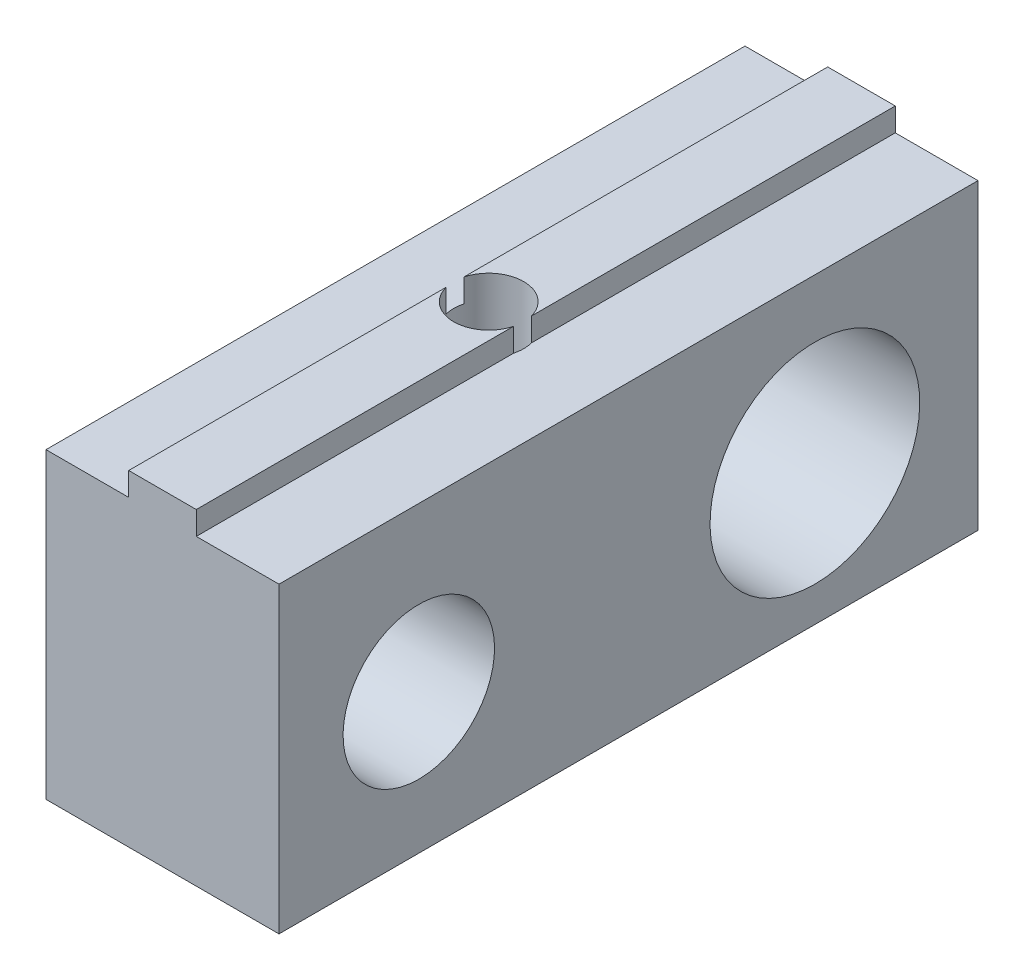
ISO-10303-21;
HEADER;
FILE_DESCRIPTION(('STEP AP214'),'2;1');
FILE_NAME('part.step','',(''),(''),'','','');
FILE_SCHEMA(('AUTOMOTIVE_DESIGN { 1 0 10303 214 1 1 1 1 }'));
ENDSEC;
DATA;
#1=APPLICATION_CONTEXT('core data for automotive mechanical design processes');
#2=APPLICATION_PROTOCOL_DEFINITION('international standard','automotive_design',2000,#1);
#3=PRODUCT_CONTEXT('',#1,'mechanical');
#4=PRODUCT('Part','Part','',(#3));
#5=PRODUCT_RELATED_PRODUCT_CATEGORY('part','',(#4));
#6=PRODUCT_DEFINITION_FORMATION('','',#4);
#7=PRODUCT_DEFINITION_CONTEXT('part definition',#1,'design');
#8=PRODUCT_DEFINITION('design','',#6,#7);
#9=PRODUCT_DEFINITION_SHAPE('','',#8);
#10=(LENGTH_UNIT() NAMED_UNIT(*) SI_UNIT(.MILLI.,.METRE.));
#11=(NAMED_UNIT(*) PLANE_ANGLE_UNIT() SI_UNIT($,.RADIAN.));
#12=(NAMED_UNIT(*) SI_UNIT($,.STERADIAN.) SOLID_ANGLE_UNIT());
#13=UNCERTAINTY_MEASURE_WITH_UNIT(LENGTH_MEASURE(1.E-05),#10,'distance_accuracy_value','');
#14=(GEOMETRIC_REPRESENTATION_CONTEXT(3) GLOBAL_UNCERTAINTY_ASSIGNED_CONTEXT((#13)) GLOBAL_UNIT_ASSIGNED_CONTEXT((#10,
#11,#12)) REPRESENTATION_CONTEXT('',''));
#15=CARTESIAN_POINT('',(0.,0.,0.));
#16=DIRECTION('',(0.,0.,1.));
#17=DIRECTION('',(1.,0.,0.));
#18=AXIS2_PLACEMENT_3D('',#15,#16,#17);
#19=CARTESIAN_POINT('',(1.45,1.,15.));
#20=DIRECTION('',(-1.,0.,0.));
#21=DIRECTION('',(0.,-1.,0.));
#22=AXIS2_PLACEMENT_3D('',#19,#20,#21);
#23=PLANE('',#22);
#24=DIRECTION('',(0.,0.,-1.));
#25=VECTOR('',#24,1.);
#26=CARTESIAN_POINT('',(1.45,2.,15.));
#27=LINE('',#26,#25);
#28=CARTESIAN_POINT('',(1.45,2.00000000000001,0.615942712606583));
#29=VERTEX_POINT('',#28);
#30=CARTESIAN_POINT('',(1.45,2.,-15.));
#31=VERTEX_POINT('',#30);
#32=EDGE_CURVE('E126',#29,#31,#27,.T.);
#33=ORIENTED_EDGE('',*,*,#32,.F.);
#34=DIRECTION('',(0.,-1.,0.));
#35=VECTOR('',#34,1.);
#36=CARTESIAN_POINT('',(1.45,2.00000000000001,0.615942712606583));
#37=LINE('',#36,#35);
#38=CARTESIAN_POINT('',(1.45,1.,0.615942712606583));
#39=VERTEX_POINT('',#38);
#40=EDGE_CURVE('E176',#29,#39,#37,.T.);
#41=ORIENTED_EDGE('',*,*,#40,.T.);
#42=DIRECTION('',(0.,0.,-1.));
#43=VECTOR('',#42,1.);
#44=CARTESIAN_POINT('',(1.45,1.,15.));
#45=LINE('',#44,#43);
#46=CARTESIAN_POINT('',(1.45,1.,-15.));
#47=VERTEX_POINT('',#46);
#48=EDGE_CURVE('E162',#39,#47,#45,.T.);
#49=ORIENTED_EDGE('',*,*,#48,.T.);
#50=DIRECTION('',(0.,1.,0.));
#51=VECTOR('',#50,1.);
#52=CARTESIAN_POINT('',(1.45,1.,-15.));
#53=LINE('',#52,#51);
#54=EDGE_CURVE('E146',#47,#31,#53,.T.);
#55=ORIENTED_EDGE('',*,*,#54,.T.);
#56=EDGE_LOOP('',(#33,#41,#49,#55));
#57=FACE_BOUND('',#56,.T.);
#58=ADVANCED_FACE('F35',(#57),#23,.F.);
#59=CARTESIAN_POINT('',(1.45,2.,15.));
#60=DIRECTION('',(0.,-1.,0.));
#61=DIRECTION('',(1.,0.,0.));
#62=AXIS2_PLACEMENT_3D('',#59,#60,#61);
#63=PLANE('',#62);
#64=CARTESIAN_POINT('',(1.45,2.,15.));
#65=VERTEX_POINT('',#64);
#66=CARTESIAN_POINT('',(1.45,2.00000000000001,1.38405728739342));
#67=VERTEX_POINT('',#66);
#68=EDGE_CURVE('E160',#65,#67,#27,.T.);
#69=ORIENTED_EDGE('',*,*,#68,.T.);
#70=CARTESIAN_POINT('',(0.,2.00000000000001,1.));
#71=DIRECTION('',(0.,-1.,0.));
#72=DIRECTION('',(1.,0.,0.));
#73=AXIS2_PLACEMENT_3D('',#70,#71,#72);
#74=CIRCLE('',#73,1.5);
#75=CARTESIAN_POINT('',(-1.45,2.00000000000001,1.38405728739345));
#76=VERTEX_POINT('',#75);
#77=EDGE_CURVE('E123',#67,#76,#74,.T.);
#78=ORIENTED_EDGE('',*,*,#77,.T.);
#79=DIRECTION('',(0.,0.,-1.));
#80=VECTOR('',#79,1.);
#81=CARTESIAN_POINT('',(-1.45,2.,15.));
#82=LINE('',#81,#80);
#83=CARTESIAN_POINT('',(-1.45,2.,15.));
#84=VERTEX_POINT('',#83);
#85=EDGE_CURVE('E119',#84,#76,#82,.T.);
#86=ORIENTED_EDGE('',*,*,#85,.F.);
#87=DIRECTION('',(-1.,0.,0.));
#88=VECTOR('',#87,1.);
#89=CARTESIAN_POINT('',(1.45,2.,15.));
#90=LINE('',#89,#88);
#91=EDGE_CURVE('E105',#65,#84,#90,.T.);
#92=ORIENTED_EDGE('',*,*,#91,.F.);
#93=EDGE_LOOP('',(#69,#78,#86,#92));
#94=FACE_BOUND('',#93,.T.);
#95=ADVANCED_FACE('F120',(#94),#63,.F.);
#96=CARTESIAN_POINT('',(-1.45,2.,15.));
#97=DIRECTION('',(1.,0.,0.));
#98=DIRECTION('',(0.,1.,0.));
#99=AXIS2_PLACEMENT_3D('',#96,#97,#98);
#100=PLANE('',#99);
#101=ORIENTED_EDGE('',*,*,#85,.T.);
#102=DIRECTION('',(0.,-1.,0.));
#103=VECTOR('',#102,1.);
#104=CARTESIAN_POINT('',(-1.45,2.00000000000001,1.38405728739345));
#105=LINE('',#104,#103);
#106=CARTESIAN_POINT('',(-1.45,1.,1.38405728739344));
#107=VERTEX_POINT('',#106);
#108=EDGE_CURVE('E241',#76,#107,#105,.T.);
#109=ORIENTED_EDGE('',*,*,#108,.T.);
#110=DIRECTION('',(0.,0.,-1.));
#111=VECTOR('',#110,1.);
#112=CARTESIAN_POINT('',(-1.45,1.,15.));
#113=LINE('',#112,#111);
#114=CARTESIAN_POINT('',(-1.45,1.,15.));
#115=VERTEX_POINT('',#114);
#116=EDGE_CURVE('E131',#115,#107,#113,.T.);
#117=ORIENTED_EDGE('',*,*,#116,.F.);
#118=DIRECTION('',(0.,-1.,0.));
#119=VECTOR('',#118,1.);
#120=CARTESIAN_POINT('',(-1.45,2.,15.));
#121=LINE('',#120,#119);
#122=EDGE_CURVE('E109',#84,#115,#121,.T.);
#123=ORIENTED_EDGE('',*,*,#122,.F.);
#124=EDGE_LOOP('',(#101,#109,#117,#123));
#125=FACE_BOUND('',#124,.T.);
#126=ADVANCED_FACE('F129',(#125),#100,.F.);
#127=CARTESIAN_POINT('',(-5.,1.,15.));
#128=DIRECTION('',(1.,0.,0.));
#129=DIRECTION('',(0.,1.,0.));
#130=AXIS2_PLACEMENT_3D('',#127,#128,#129);
#131=PLANE('',#130);
#132=DIRECTION('',(0.,-1.,0.));
#133=VECTOR('',#132,1.);
#134=CARTESIAN_POINT('',(-5.,1.,-15.));
#135=LINE('',#134,#133);
#136=CARTESIAN_POINT('',(-5.,1.,-15.));
#137=VERTEX_POINT('',#136);
#138=CARTESIAN_POINT('',(-5.,-12.,-15.));
#139=VERTEX_POINT('',#138);
#140=EDGE_CURVE('E137',#137,#139,#135,.T.);
#141=ORIENTED_EDGE('',*,*,#140,.T.);
#142=DIRECTION('',(0.,0.,1.));
#143=VECTOR('',#142,1.);
#144=CARTESIAN_POINT('',(-5.,-12.,15.));
#145=LINE('',#144,#143);
#146=CARTESIAN_POINT('',(-5.,-12.,15.));
#147=VERTEX_POINT('',#146);
#148=EDGE_CURVE('E218',#139,#147,#145,.T.);
#149=ORIENTED_EDGE('',*,*,#148,.T.);
#150=DIRECTION('',(0.,-1.,0.));
#151=VECTOR('',#150,1.);
#152=CARTESIAN_POINT('',(-5.,1.,15.));
#153=LINE('',#152,#151);
#154=CARTESIAN_POINT('',(-5.,1.,15.));
#155=VERTEX_POINT('',#154);
#156=EDGE_CURVE('E156',#155,#147,#153,.T.);
#157=ORIENTED_EDGE('',*,*,#156,.F.);
#158=DIRECTION('',(0.,0.,-1.));
#159=VECTOR('',#158,1.);
#160=CARTESIAN_POINT('',(-5.,1.,15.));
#161=LINE('',#160,#159);
#162=EDGE_CURVE('E133',#155,#137,#161,.T.);
#163=ORIENTED_EDGE('',*,*,#162,.T.);
#164=EDGE_LOOP('',(#141,#149,#157,#163));
#165=FACE_BOUND('',#164,.T.);
#166=CARTESIAN_POINT('',(-5.,-5.99999999999998,-8.));
#167=DIRECTION('',(-1.,0.,0.));
#168=DIRECTION('',(0.,-1.,0.));
#169=AXIS2_PLACEMENT_3D('',#166,#167,#168);
#170=CIRCLE('',#169,4.5);
#171=CARTESIAN_POINT('',(-5.,-10.5,-8.));
#172=VERTEX_POINT('',#171);
#173=EDGE_CURVE('E251',#172,#172,#170,.T.);
#174=ORIENTED_EDGE('',*,*,#173,.F.);
#175=EDGE_LOOP('',(#174));
#176=FACE_BOUND('',#175,.T.);
#177=CARTESIAN_POINT('',(-5.,-5.99999999999998,9.));
#178=DIRECTION('',(-1.,0.,0.));
#179=DIRECTION('',(0.,-1.,0.));
#180=AXIS2_PLACEMENT_3D('',#177,#178,#179);
#181=CIRCLE('',#180,3.25);
#182=CARTESIAN_POINT('',(-5.,-9.24999999999998,9.));
#183=VERTEX_POINT('',#182);
#184=EDGE_CURVE('E228',#183,#183,#181,.T.);
#185=ORIENTED_EDGE('',*,*,#184,.F.);
#186=EDGE_LOOP('',(#185));
#187=FACE_BOUND('',#186,.T.);
#188=ADVANCED_FACE('F37',(#165,#176,#187),#131,.F.);
#189=CARTESIAN_POINT('',(5.,0.,15.));
#190=DIRECTION('',(-1.,0.,0.));
#191=DIRECTION('',(0.,-1.,0.));
#192=AXIS2_PLACEMENT_3D('',#189,#190,#191);
#193=PLANE('',#192);
#194=DIRECTION('',(0.,1.,0.));
#195=VECTOR('',#194,1.);
#196=CARTESIAN_POINT('',(5.,0.,-15.));
#197=LINE('',#196,#195);
#198=CARTESIAN_POINT('',(5.,-12.,-15.));
#199=VERTEX_POINT('',#198);
#200=CARTESIAN_POINT('',(5.,1.,-15.));
#201=VERTEX_POINT('',#200);
#202=EDGE_CURVE('E140',#199,#201,#197,.T.);
#203=ORIENTED_EDGE('',*,*,#202,.T.);
#204=DIRECTION('',(0.,0.,-1.));
#205=VECTOR('',#204,1.);
#206=CARTESIAN_POINT('',(5.,1.,15.));
#207=LINE('',#206,#205);
#208=CARTESIAN_POINT('',(5.,1.,15.));
#209=VERTEX_POINT('',#208);
#210=EDGE_CURVE('E11',#209,#201,#207,.T.);
#211=ORIENTED_EDGE('',*,*,#210,.F.);
#212=DIRECTION('',(0.,1.,0.));
#213=VECTOR('',#212,1.);
#214=CARTESIAN_POINT('',(5.,0.,15.));
#215=LINE('',#214,#213);
#216=CARTESIAN_POINT('',(5.,-12.,15.));
#217=VERTEX_POINT('',#216);
#218=EDGE_CURVE('E94',#217,#209,#215,.T.);
#219=ORIENTED_EDGE('',*,*,#218,.F.);
#220=DIRECTION('',(0.,0.,1.));
#221=VECTOR('',#220,1.);
#222=CARTESIAN_POINT('',(5.,-12.,15.));
#223=LINE('',#222,#221);
#224=EDGE_CURVE('E220',#199,#217,#223,.T.);
#225=ORIENTED_EDGE('',*,*,#224,.F.);
#226=EDGE_LOOP('',(#203,#211,#219,#225));
#227=FACE_BOUND('',#226,.T.);
#228=CARTESIAN_POINT('',(5.,-5.99999999999998,-8.));
#229=DIRECTION('',(-1.,0.,0.));
#230=DIRECTION('',(0.,-1.,0.));
#231=AXIS2_PLACEMENT_3D('',#228,#229,#230);
#232=CIRCLE('',#231,4.5);
#233=CARTESIAN_POINT('',(5.,-10.5,-8.));
#234=VERTEX_POINT('',#233);
#235=EDGE_CURVE('E252',#234,#234,#232,.T.);
#236=ORIENTED_EDGE('',*,*,#235,.T.);
#237=EDGE_LOOP('',(#236));
#238=FACE_BOUND('',#237,.T.);
#239=CARTESIAN_POINT('',(5.,-5.99999999999998,9.));
#240=DIRECTION('',(-1.,0.,0.));
#241=DIRECTION('',(0.,-1.,0.));
#242=AXIS2_PLACEMENT_3D('',#239,#240,#241);
#243=CIRCLE('',#242,3.25);
#244=CARTESIAN_POINT('',(5.,-9.24999999999998,9.));
#245=VERTEX_POINT('',#244);
#246=EDGE_CURVE('E224',#245,#245,#243,.T.);
#247=ORIENTED_EDGE('',*,*,#246,.T.);
#248=EDGE_LOOP('',(#247));
#249=FACE_BOUND('',#248,.T.);
#250=ADVANCED_FACE('F262',(#227,#238,#249),#193,.F.);
#251=CARTESIAN_POINT('',(5.,1.,15.));
#252=DIRECTION('',(0.,-1.,0.));
#253=DIRECTION('',(1.,0.,0.));
#254=AXIS2_PLACEMENT_3D('',#251,#252,#253);
#255=PLANE('',#254);
#256=ORIENTED_EDGE('',*,*,#48,.F.);
#257=CARTESIAN_POINT('',(0.,1.,1.));
#258=DIRECTION('',(0.,-1.,0.));
#259=DIRECTION('',(1.,0.,0.));
#260=AXIS2_PLACEMENT_3D('',#257,#258,#259);
#261=CIRCLE('',#260,1.5);
#262=CARTESIAN_POINT('',(1.45,1.,1.38405728739342));
#263=VERTEX_POINT('',#262);
#264=EDGE_CURVE('E235',#39,#263,#261,.T.);
#265=ORIENTED_EDGE('',*,*,#264,.T.);
#266=CARTESIAN_POINT('',(1.45,1.,15.));
#267=VERTEX_POINT('',#266);
#268=EDGE_CURVE('E44',#267,#263,#45,.T.);
#269=ORIENTED_EDGE('',*,*,#268,.F.);
#270=DIRECTION('',(-1.,0.,0.));
#271=VECTOR('',#270,1.);
#272=CARTESIAN_POINT('',(5.,1.,15.));
#273=LINE('',#272,#271);
#274=EDGE_CURVE('E234',#209,#267,#273,.T.);
#275=ORIENTED_EDGE('',*,*,#274,.F.);
#276=ORIENTED_EDGE('',*,*,#210,.T.);
#277=DIRECTION('',(-1.,0.,0.));
#278=VECTOR('',#277,1.);
#279=CARTESIAN_POINT('',(5.,1.,-15.));
#280=LINE('',#279,#278);
#281=EDGE_CURVE('E143',#201,#47,#280,.T.);
#282=ORIENTED_EDGE('',*,*,#281,.T.);
#283=EDGE_LOOP('',(#256,#265,#269,#275,#276,#282));
#284=FACE_BOUND('',#283,.T.);
#285=ADVANCED_FACE('F180',(#284),#255,.F.);
#286=ORIENTED_EDGE('',*,*,#268,.T.);
#287=DIRECTION('',(0.,-1.,0.));
#288=VECTOR('',#287,1.);
#289=CARTESIAN_POINT('',(1.45,2.00000000000001,1.38405728739342));
#290=LINE('',#289,#288);
#291=EDGE_CURVE('E238',#263,#67,#290,.F.);
#292=ORIENTED_EDGE('',*,*,#291,.T.);
#293=ORIENTED_EDGE('',*,*,#68,.F.);
#294=DIRECTION('',(0.,1.,0.));
#295=VECTOR('',#294,1.);
#296=CARTESIAN_POINT('',(1.45,1.,15.));
#297=LINE('',#296,#295);
#298=EDGE_CURVE('E112',#267,#65,#297,.T.);
#299=ORIENTED_EDGE('',*,*,#298,.F.);
#300=EDGE_LOOP('',(#286,#292,#293,#299));
#301=FACE_BOUND('',#300,.T.);
#302=ADVANCED_FACE('F236',(#301),#23,.F.);
#303=CARTESIAN_POINT('',(-1.45,2.00000000000001,0.61594271260656));
#304=VERTEX_POINT('',#303);
#305=CARTESIAN_POINT('',(-1.45,2.,-15.));
#306=VERTEX_POINT('',#305);
#307=EDGE_CURVE('E127',#304,#306,#82,.T.);
#308=ORIENTED_EDGE('',*,*,#307,.F.);
#309=EDGE_CURVE('E193',#304,#29,#74,.T.);
#310=ORIENTED_EDGE('',*,*,#309,.T.);
#311=ORIENTED_EDGE('',*,*,#32,.T.);
#312=DIRECTION('',(-1.,0.,0.));
#313=VECTOR('',#312,1.);
#314=CARTESIAN_POINT('',(1.45,2.,-15.));
#315=LINE('',#314,#313);
#316=EDGE_CURVE('E149',#31,#306,#315,.T.);
#317=ORIENTED_EDGE('',*,*,#316,.T.);
#318=EDGE_LOOP('',(#308,#310,#311,#317));
#319=FACE_BOUND('',#318,.T.);
#320=ADVANCED_FACE('F189',(#319),#63,.F.);
#321=CARTESIAN_POINT('',(-1.45,1.,0.615942712606561));
#322=VERTEX_POINT('',#321);
#323=CARTESIAN_POINT('',(-1.45,1.,-15.));
#324=VERTEX_POINT('',#323);
#325=EDGE_CURVE('E158',#322,#324,#113,.T.);
#326=ORIENTED_EDGE('',*,*,#325,.F.);
#327=DIRECTION('',(0.,-1.,0.));
#328=VECTOR('',#327,1.);
#329=CARTESIAN_POINT('',(-1.45,2.00000000000001,0.61594271260656));
#330=LINE('',#329,#328);
#331=EDGE_CURVE('E51',#322,#304,#330,.F.);
#332=ORIENTED_EDGE('',*,*,#331,.T.);
#333=ORIENTED_EDGE('',*,*,#307,.T.);
#334=DIRECTION('',(0.,-1.,0.));
#335=VECTOR('',#334,1.);
#336=CARTESIAN_POINT('',(-1.45,2.,-15.));
#337=LINE('',#336,#335);
#338=EDGE_CURVE('E152',#306,#324,#337,.T.);
#339=ORIENTED_EDGE('',*,*,#338,.T.);
#340=EDGE_LOOP('',(#326,#332,#333,#339));
#341=FACE_BOUND('',#340,.T.);
#342=ADVANCED_FACE('F269',(#341),#100,.F.);
#343=CARTESIAN_POINT('',(-1.45,1.,15.));
#344=DIRECTION('',(0.,-1.,0.));
#345=DIRECTION('',(1.,0.,0.));
#346=AXIS2_PLACEMENT_3D('',#343,#344,#345);
#347=PLANE('',#346);
#348=ORIENTED_EDGE('',*,*,#116,.T.);
#349=CARTESIAN_POINT('',(0.,1.,1.));
#350=DIRECTION('',(0.,-1.,0.));
#351=DIRECTION('',(1.,0.,0.));
#352=AXIS2_PLACEMENT_3D('',#349,#350,#351);
#353=CIRCLE('',#352,1.5);
#354=EDGE_CURVE('E243',#107,#322,#353,.T.);
#355=ORIENTED_EDGE('',*,*,#354,.T.);
#356=ORIENTED_EDGE('',*,*,#325,.T.);
#357=DIRECTION('',(-1.,0.,0.));
#358=VECTOR('',#357,1.);
#359=CARTESIAN_POINT('',(-1.45,1.,-15.));
#360=LINE('',#359,#358);
#361=EDGE_CURVE('E86',#324,#137,#360,.T.);
#362=ORIENTED_EDGE('',*,*,#361,.T.);
#363=ORIENTED_EDGE('',*,*,#162,.F.);
#364=DIRECTION('',(-1.,0.,0.));
#365=VECTOR('',#364,1.);
#366=CARTESIAN_POINT('',(-1.45,1.,15.));
#367=LINE('',#366,#365);
#368=EDGE_CURVE('E60',#115,#155,#367,.T.);
#369=ORIENTED_EDGE('',*,*,#368,.F.);
#370=EDGE_LOOP('',(#348,#355,#356,#362,#363,#369));
#371=FACE_BOUND('',#370,.T.);
#372=ADVANCED_FACE('F301',(#371),#347,.F.);
#373=CARTESIAN_POINT('',(0.,0.,15.));
#374=DIRECTION('',(0.,0.,1.));
#375=DIRECTION('',(1.,0.,0.));
#376=AXIS2_PLACEMENT_3D('',#373,#374,#375);
#377=PLANE('',#376);
#378=ORIENTED_EDGE('',*,*,#156,.T.);
#379=DIRECTION('',(-1.,0.,0.));
#380=VECTOR('',#379,1.);
#381=CARTESIAN_POINT('',(5.,-12.,15.));
#382=LINE('',#381,#380);
#383=EDGE_CURVE('E141',#217,#147,#382,.T.);
#384=ORIENTED_EDGE('',*,*,#383,.F.);
#385=ORIENTED_EDGE('',*,*,#218,.T.);
#386=ORIENTED_EDGE('',*,*,#274,.T.);
#387=ORIENTED_EDGE('',*,*,#298,.T.);
#388=ORIENTED_EDGE('',*,*,#91,.T.);
#389=ORIENTED_EDGE('',*,*,#122,.T.);
#390=ORIENTED_EDGE('',*,*,#368,.T.);
#391=EDGE_LOOP('',(#378,#384,#385,#386,#387,#388,#389,#390));
#392=FACE_BOUND('',#391,.T.);
#393=ADVANCED_FACE('F107',(#392),#377,.T.);
#394=CARTESIAN_POINT('',(0.,0.,-15.));
#395=DIRECTION('',(0.,0.,1.));
#396=DIRECTION('',(1.,0.,0.));
#397=AXIS2_PLACEMENT_3D('',#394,#395,#396);
#398=PLANE('',#397);
#399=ORIENTED_EDGE('',*,*,#140,.F.);
#400=ORIENTED_EDGE('',*,*,#361,.F.);
#401=ORIENTED_EDGE('',*,*,#338,.F.);
#402=ORIENTED_EDGE('',*,*,#316,.F.);
#403=ORIENTED_EDGE('',*,*,#54,.F.);
#404=ORIENTED_EDGE('',*,*,#281,.F.);
#405=ORIENTED_EDGE('',*,*,#202,.F.);
#406=DIRECTION('',(-1.,0.,0.));
#407=VECTOR('',#406,1.);
#408=CARTESIAN_POINT('',(5.,-12.,-15.));
#409=LINE('',#408,#407);
#410=EDGE_CURVE('E221',#199,#139,#409,.T.);
#411=ORIENTED_EDGE('',*,*,#410,.T.);
#412=EDGE_LOOP('',(#399,#400,#401,#402,#403,#404,#405,#411));
#413=FACE_BOUND('',#412,.T.);
#414=ADVANCED_FACE('F185',(#413),#398,.F.);
#415=CARTESIAN_POINT('',(5.,-12.,15.));
#416=DIRECTION('',(0.,-1.,0.));
#417=DIRECTION('',(1.,0.,0.));
#418=AXIS2_PLACEMENT_3D('',#415,#416,#417);
#419=PLANE('',#418);
#420=CARTESIAN_POINT('',(0.,-12.,1.));
#421=DIRECTION('',(0.,1.,0.));
#422=DIRECTION('',(-1.,0.,0.));
#423=AXIS2_PLACEMENT_3D('',#420,#421,#422);
#424=CIRCLE('',#423,4.25);
#425=CARTESIAN_POINT('',(-4.25,-12.,1.));
#426=VERTEX_POINT('',#425);
#427=EDGE_CURVE('E397',#426,#426,#424,.T.);
#428=ORIENTED_EDGE('',*,*,#427,.T.);
#429=EDGE_LOOP('',(#428));
#430=FACE_BOUND('',#429,.T.);
#431=ORIENTED_EDGE('',*,*,#148,.F.);
#432=ORIENTED_EDGE('',*,*,#410,.F.);
#433=ORIENTED_EDGE('',*,*,#224,.T.);
#434=ORIENTED_EDGE('',*,*,#383,.T.);
#435=EDGE_LOOP('',(#431,#432,#433,#434));
#436=FACE_BOUND('',#435,.T.);
#437=ADVANCED_FACE('F216',(#430,#436),#419,.T.);
#438=CARTESIAN_POINT('',(5.,-5.99999999999998,9.));
#439=DIRECTION('',(-1.,0.,0.));
#440=DIRECTION('',(0.,-1.,0.));
#441=AXIS2_PLACEMENT_3D('',#438,#439,#440);
#442=CYLINDRICAL_SURFACE('',#441,3.25);
#443=ORIENTED_EDGE('',*,*,#246,.F.);
#444=EDGE_LOOP('',(#443));
#445=FACE_BOUND('',#444,.T.);
#446=ORIENTED_EDGE('',*,*,#184,.T.);
#447=EDGE_LOOP('',(#446));
#448=FACE_BOUND('',#447,.T.);
#449=ADVANCED_FACE('F259',(#445,#448),#442,.F.);
#450=CARTESIAN_POINT('',(5.,-5.99999999999998,-8.));
#451=DIRECTION('',(-1.,0.,0.));
#452=DIRECTION('',(0.,-1.,0.));
#453=AXIS2_PLACEMENT_3D('',#450,#451,#452);
#454=CYLINDRICAL_SURFACE('',#453,4.5);
#455=ORIENTED_EDGE('',*,*,#235,.F.);
#456=EDGE_LOOP('',(#455));
#457=FACE_BOUND('',#456,.T.);
#458=ORIENTED_EDGE('',*,*,#173,.T.);
#459=EDGE_LOOP('',(#458));
#460=FACE_BOUND('',#459,.T.);
#461=ADVANCED_FACE('F323',(#457,#460),#454,.F.);
#462=CARTESIAN_POINT('',(0.,2.00000000000001,1.));
#463=DIRECTION('',(0.,-1.,0.));
#464=DIRECTION('',(1.,0.,0.));
#465=AXIS2_PLACEMENT_3D('',#462,#463,#464);
#466=CYLINDRICAL_SURFACE('',#465,1.5);
#467=CARTESIAN_POINT('',(0.,-6.,1.));
#468=DIRECTION('',(0.,1.,0.));
#469=DIRECTION('',(-1.,0.,0.));
#470=AXIS2_PLACEMENT_3D('',#467,#468,#469);
#471=CIRCLE('',#470,1.5);
#472=CARTESIAN_POINT('',(-1.5,-6.,1.));
#473=VERTEX_POINT('',#472);
#474=EDGE_CURVE('E39',#473,#473,#471,.F.);
#475=ORIENTED_EDGE('',*,*,#474,.T.);
#476=EDGE_LOOP('',(#475));
#477=FACE_BOUND('',#476,.T.);
#478=ORIENTED_EDGE('',*,*,#309,.F.);
#479=ORIENTED_EDGE('',*,*,#331,.F.);
#480=ORIENTED_EDGE('',*,*,#354,.F.);
#481=ORIENTED_EDGE('',*,*,#108,.F.);
#482=ORIENTED_EDGE('',*,*,#77,.F.);
#483=ORIENTED_EDGE('',*,*,#291,.F.);
#484=ORIENTED_EDGE('',*,*,#264,.F.);
#485=ORIENTED_EDGE('',*,*,#40,.F.);
#486=EDGE_LOOP('',(#478,#479,#480,#481,#482,#483,#484,#485));
#487=FACE_BOUND('',#486,.T.);
#488=ADVANCED_FACE('F242',(#477,#487),#466,.F.);
#489=CARTESIAN_POINT('',(0.,-6.,1.));
#490=DIRECTION('',(0.,1.,0.));
#491=DIRECTION('',(-1.,0.,0.));
#492=AXIS2_PLACEMENT_3D('',#489,#490,#491);
#493=PLANE('',#492);
#494=CARTESIAN_POINT('',(0.,-6.,1.));
#495=DIRECTION('',(0.,1.,0.));
#496=DIRECTION('',(-1.,0.,0.));
#497=AXIS2_PLACEMENT_3D('',#494,#495,#496);
#498=CIRCLE('',#497,4.25);
#499=CARTESIAN_POINT('',(-4.25,-6.,1.));
#500=VERTEX_POINT('',#499);
#501=EDGE_CURVE('E394',#500,#500,#498,.T.);
#502=ORIENTED_EDGE('',*,*,#501,.F.);
#503=EDGE_LOOP('',(#502));
#504=FACE_BOUND('',#503,.T.);
#505=ORIENTED_EDGE('',*,*,#474,.F.);
#506=EDGE_LOOP('',(#505));
#507=FACE_BOUND('',#506,.T.);
#508=ADVANCED_FACE('F358',(#504,#507),#493,.F.);
#509=CARTESIAN_POINT('',(0.,-12.,1.));
#510=DIRECTION('',(0.,1.,0.));
#511=DIRECTION('',(-1.,0.,0.));
#512=AXIS2_PLACEMENT_3D('',#509,#510,#511);
#513=CYLINDRICAL_SURFACE('',#512,4.25);
#514=ORIENTED_EDGE('',*,*,#427,.F.);
#515=EDGE_LOOP('',(#514));
#516=FACE_BOUND('',#515,.T.);
#517=ORIENTED_EDGE('',*,*,#501,.T.);
#518=EDGE_LOOP('',(#517));
#519=FACE_BOUND('',#518,.T.);
#520=ADVANCED_FACE('F368',(#516,#519),#513,.F.);
#521=CLOSED_SHELL('',(#58,#95,#126,#188,#250,#285,#302,#320,#342,#372,#393,#414,#437,#449,#461,
#488,#508,#520));
#522=MANIFOLD_SOLID_BREP('B2',#521);
#523=ADVANCED_BREP_SHAPE_REPRESENTATION('',(#18,#522),#14);
#524=SHAPE_DEFINITION_REPRESENTATION(#9,#523);
ENDSEC;
END-ISO-10303-21;
